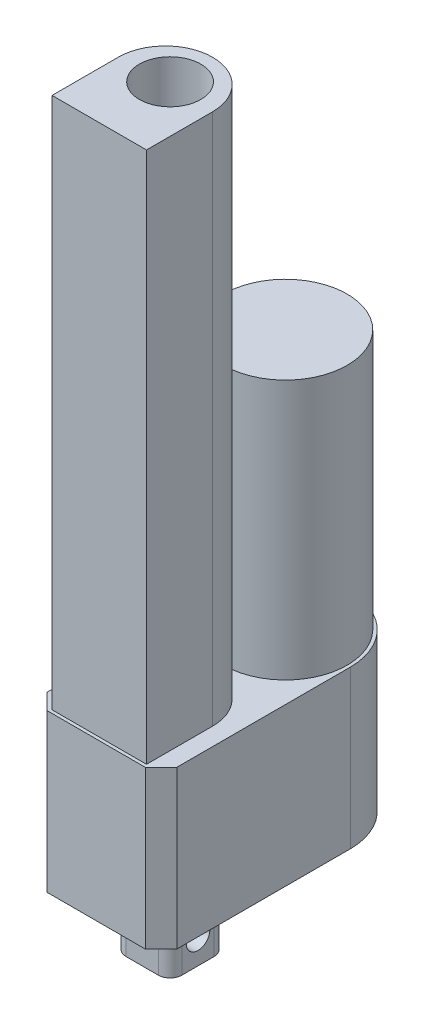
ISO-10303-21;
HEADER;
FILE_DESCRIPTION(('STEP AP214'),'2;1');
FILE_NAME('part.step','',(''),(''),'','','');
FILE_SCHEMA(('AUTOMOTIVE_DESIGN { 1 0 10303 214 1 1 1 1 }'));
ENDSEC;
DATA;
#1=APPLICATION_CONTEXT('core data for automotive mechanical design processes');
#2=APPLICATION_PROTOCOL_DEFINITION('international standard','automotive_design',2000,#1);
#3=PRODUCT_CONTEXT('',#1,'mechanical');
#4=PRODUCT('Part','Part','',(#3));
#5=PRODUCT_RELATED_PRODUCT_CATEGORY('part','',(#4));
#6=PRODUCT_DEFINITION_FORMATION('','',#4);
#7=PRODUCT_DEFINITION_CONTEXT('part definition',#1,'design');
#8=PRODUCT_DEFINITION('design','',#6,#7);
#9=PRODUCT_DEFINITION_SHAPE('','',#8);
#10=(LENGTH_UNIT() NAMED_UNIT(*) SI_UNIT(.MILLI.,.METRE.));
#11=(NAMED_UNIT(*) PLANE_ANGLE_UNIT() SI_UNIT($,.RADIAN.));
#12=(NAMED_UNIT(*) SI_UNIT($,.STERADIAN.) SOLID_ANGLE_UNIT());
#13=UNCERTAINTY_MEASURE_WITH_UNIT(LENGTH_MEASURE(1.E-05),#10,'distance_accuracy_value','');
#14=(GEOMETRIC_REPRESENTATION_CONTEXT(3) GLOBAL_UNCERTAINTY_ASSIGNED_CONTEXT((#13)) GLOBAL_UNIT_ASSIGNED_CONTEXT((#10,
#11,#12)) REPRESENTATION_CONTEXT('',''));
#15=CARTESIAN_POINT('',(0.,0.,0.));
#16=DIRECTION('',(0.,0.,1.));
#17=DIRECTION('',(1.,0.,0.));
#18=AXIS2_PLACEMENT_3D('',#15,#16,#17);
#19=CARTESIAN_POINT('',(-29.9066354603378,0.,-28.37671645601));
#20=DIRECTION('',(0.,1.,0.));
#21=DIRECTION('',(0.,0.,1.));
#22=AXIS2_PLACEMENT_3D('',#19,#20,#21);
#23=PLANE('',#22);
#24=CARTESIAN_POINT('',(-29.9066354603378,0.,-28.37671645601));
#25=DIRECTION('',(0.,1.,0.));
#26=DIRECTION('',(0.,0.,1.));
#27=AXIS2_PLACEMENT_3D('',#24,#25,#26);
#28=CIRCLE('',#27,20.9296);
#29=CARTESIAN_POINT('',(-29.9066354603376,0.,-49.30631645601));
#30=VERTEX_POINT('',#29);
#31=CARTESIAN_POINT('',(-50.8362354603378,0.,-28.3767164560098));
#32=VERTEX_POINT('',#31);
#33=EDGE_CURVE('E231',#30,#32,#28,.T.);
#34=ORIENTED_EDGE('',*,*,#33,.F.);
#35=DIRECTION('',(-1.,0.,0.));
#36=VECTOR('',#35,1.);
#37=CARTESIAN_POINT('',(-29.9066354603376,0.,-49.30631645601));
#38=LINE('',#37,#36);
#39=CARTESIAN_POINT('',(-29.8558354603379,0.,-49.30631645601));
#40=VERTEX_POINT('',#39);
#41=EDGE_CURVE('E238',#40,#30,#38,.T.);
#42=ORIENTED_EDGE('',*,*,#41,.F.);
#43=CARTESIAN_POINT('',(-29.8558354603378,0.,-28.37671645601));
#44=DIRECTION('',(0.,1.,0.));
#45=DIRECTION('',(0.,0.,-1.));
#46=AXIS2_PLACEMENT_3D('',#43,#44,#45);
#47=CIRCLE('',#46,20.9296);
#48=CARTESIAN_POINT('',(-8.92623546033779,0.,-28.3767164560098));
#49=VERTEX_POINT('',#48);
#50=EDGE_CURVE('E265',#49,#40,#47,.T.);
#51=ORIENTED_EDGE('',*,*,#50,.F.);
#52=DIRECTION('',(0.,0.,-1.));
#53=VECTOR('',#52,1.);
#54=CARTESIAN_POINT('',(-8.92623546033779,0.,-28.3767164560098));
#55=LINE('',#54,#53);
#56=CARTESIAN_POINT('',(-8.92623546033777,0.,27.65568354399));
#57=VERTEX_POINT('',#56);
#58=EDGE_CURVE('E263',#57,#49,#55,.T.);
#59=ORIENTED_EDGE('',*,*,#58,.F.);
#60=DIRECTION('',(0.707106781186549,0.,-0.707106781186546));
#61=VECTOR('',#60,1.);
#62=CARTESIAN_POINT('',(-14.0062354603378,0.,32.73568354399));
#63=LINE('',#62,#61);
#64=CARTESIAN_POINT('',(-14.0062354603378,0.,32.73568354399));
#65=VERTEX_POINT('',#64);
#66=EDGE_CURVE('E261',#65,#57,#63,.T.);
#67=ORIENTED_EDGE('',*,*,#66,.F.);
#68=DIRECTION('',(1.,0.,0.));
#69=VECTOR('',#68,1.);
#70=CARTESIAN_POINT('',(-45.7562354603378,0.,32.73568354399));
#71=LINE('',#70,#69);
#72=CARTESIAN_POINT('',(-45.7562354603378,0.,32.73568354399));
#73=VERTEX_POINT('',#72);
#74=EDGE_CURVE('E259',#73,#65,#71,.T.);
#75=ORIENTED_EDGE('',*,*,#74,.F.);
#76=DIRECTION('',(0.707106781186546,0.,0.707106781186548));
#77=VECTOR('',#76,1.);
#78=CARTESIAN_POINT('',(-50.8362354603378,0.,27.65568354399));
#79=LINE('',#78,#77);
#80=CARTESIAN_POINT('',(-50.8362354603378,0.,27.65568354399));
#81=VERTEX_POINT('',#80);
#82=EDGE_CURVE('E257',#81,#73,#79,.T.);
#83=ORIENTED_EDGE('',*,*,#82,.F.);
#84=DIRECTION('',(0.,0.,1.));
#85=VECTOR('',#84,1.);
#86=CARTESIAN_POINT('',(-50.8362354603378,0.,-28.3767164560098));
#87=LINE('',#86,#85);
#88=EDGE_CURVE('E255',#32,#81,#87,.T.);
#89=ORIENTED_EDGE('',*,*,#88,.F.);
#90=EDGE_LOOP('',(#34,#42,#51,#59,#67,#75,#83,#89));
#91=FACE_BOUND('',#90,.T.);
#92=CARTESIAN_POINT('',(-35.0882354603378,0.,3.65268354399004));
#93=DIRECTION('',(0.,-1.,0.));
#94=DIRECTION('',(0.,0.,1.));
#95=AXIS2_PLACEMENT_3D('',#92,#93,#94);
#96=CIRCLE('',#95,3.81);
#97=CARTESIAN_POINT('',(-38.8982354603378,0.,3.65268354399004));
#98=VERTEX_POINT('',#97);
#99=CARTESIAN_POINT('',(-35.0882354603378,0.,-0.157316456009964));
#100=VERTEX_POINT('',#99);
#101=EDGE_CURVE('E192',#98,#100,#96,.T.);
#102=ORIENTED_EDGE('',*,*,#101,.F.);
#103=DIRECTION('',(0.,0.,-1.));
#104=VECTOR('',#103,1.);
#105=CARTESIAN_POINT('',(-38.8982354603378,0.,3.65268354399004));
#106=LINE('',#105,#104);
#107=CARTESIAN_POINT('',(-38.8982354603378,0.,14.06668354399));
#108=VERTEX_POINT('',#107);
#109=EDGE_CURVE('E189',#108,#98,#106,.T.);
#110=ORIENTED_EDGE('',*,*,#109,.F.);
#111=CARTESIAN_POINT('',(-35.0882354603378,0.,14.06668354399));
#112=DIRECTION('',(0.,-1.,0.));
#113=DIRECTION('',(0.,0.,-1.));
#114=AXIS2_PLACEMENT_3D('',#111,#112,#113);
#115=CIRCLE('',#114,3.80999999999999);
#116=CARTESIAN_POINT('',(-35.0882354603378,0.,17.87668354399));
#117=VERTEX_POINT('',#116);
#118=EDGE_CURVE('E458',#117,#108,#115,.T.);
#119=ORIENTED_EDGE('',*,*,#118,.F.);
#120=DIRECTION('',(-1.,0.,0.));
#121=VECTOR('',#120,1.);
#122=CARTESIAN_POINT('',(-24.6742354603378,0.,17.87668354399));
#123=LINE('',#122,#121);
#124=CARTESIAN_POINT('',(-24.6742354603378,0.,17.87668354399));
#125=VERTEX_POINT('',#124);
#126=EDGE_CURVE('E455',#125,#117,#123,.T.);
#127=ORIENTED_EDGE('',*,*,#126,.F.);
#128=CARTESIAN_POINT('',(-24.6742354603378,0.,14.06668354399));
#129=DIRECTION('',(0.,-1.,0.));
#130=DIRECTION('',(0.,0.,-1.));
#131=AXIS2_PLACEMENT_3D('',#128,#129,#130);
#132=CIRCLE('',#131,3.81);
#133=CARTESIAN_POINT('',(-20.8642354603378,0.,14.06668354399));
#134=VERTEX_POINT('',#133);
#135=EDGE_CURVE('E452',#134,#125,#132,.T.);
#136=ORIENTED_EDGE('',*,*,#135,.F.);
#137=DIRECTION('',(0.,0.,1.));
#138=VECTOR('',#137,1.);
#139=CARTESIAN_POINT('',(-20.8642354603378,0.,3.65268354399004));
#140=LINE('',#139,#138);
#141=CARTESIAN_POINT('',(-20.8642354603378,0.,3.65268354399004));
#142=VERTEX_POINT('',#141);
#143=EDGE_CURVE('E449',#142,#134,#140,.T.);
#144=ORIENTED_EDGE('',*,*,#143,.F.);
#145=CARTESIAN_POINT('',(-24.6742354603378,0.,3.65268354399004));
#146=DIRECTION('',(0.,-1.,0.));
#147=DIRECTION('',(0.,0.,-1.));
#148=AXIS2_PLACEMENT_3D('',#145,#146,#147);
#149=CIRCLE('',#148,3.81);
#150=CARTESIAN_POINT('',(-24.6742354603378,0.,-0.157316456009966));
#151=VERTEX_POINT('',#150);
#152=EDGE_CURVE('E55',#151,#142,#149,.T.);
#153=ORIENTED_EDGE('',*,*,#152,.F.);
#154=DIRECTION('',(1.,0.,0.));
#155=VECTOR('',#154,1.);
#156=CARTESIAN_POINT('',(-24.6742354603378,0.,-0.157316456009964));
#157=LINE('',#156,#155);
#158=EDGE_CURVE('E50',#100,#151,#157,.T.);
#159=ORIENTED_EDGE('',*,*,#158,.F.);
#160=EDGE_LOOP('',(#102,#110,#119,#127,#136,#144,#153,#159));
#161=FACE_BOUND('',#160,.T.);
#162=ADVANCED_FACE('F35',(#91,#161),#23,.F.);
#163=CARTESIAN_POINT('',(-29.9066354603378,50.8,-28.37671645601));
#164=DIRECTION('',(0.,1.,0.));
#165=DIRECTION('',(0.,0.,1.));
#166=AXIS2_PLACEMENT_3D('',#163,#164,#165);
#167=PLANE('',#166);
#168=CARTESIAN_POINT('',(-29.8812354603378,50.8,-28.35131645601));
#169=DIRECTION('',(0.,1.,0.));
#170=DIRECTION('',(0.,0.,1.));
#171=AXIS2_PLACEMENT_3D('',#168,#169,#170);
#172=CIRCLE('',#171,19.939);
#173=CARTESIAN_POINT('',(-29.8812354603378,50.8,-8.41231645600997));
#174=VERTEX_POINT('',#173);
#175=EDGE_CURVE('E227',#174,#174,#172,.T.);
#176=ORIENTED_EDGE('',*,*,#175,.F.);
#177=EDGE_LOOP('',(#176));
#178=FACE_BOUND('',#177,.T.);
#179=CARTESIAN_POINT('',(-29.9066354603378,50.8,-28.37671645601));
#180=DIRECTION('',(0.,1.,0.));
#181=DIRECTION('',(0.,0.,1.));
#182=AXIS2_PLACEMENT_3D('',#179,#180,#181);
#183=CIRCLE('',#182,20.9296);
#184=CARTESIAN_POINT('',(-29.9066354603376,50.8,-49.30631645601));
#185=VERTEX_POINT('',#184);
#186=CARTESIAN_POINT('',(-50.8362354603378,50.8,-28.3767164560098));
#187=VERTEX_POINT('',#186);
#188=EDGE_CURVE('E234',#185,#187,#183,.T.);
#189=ORIENTED_EDGE('',*,*,#188,.T.);
#190=DIRECTION('',(0.,0.,1.));
#191=VECTOR('',#190,1.);
#192=CARTESIAN_POINT('',(-50.8362354603378,50.8,-28.3767164560098));
#193=LINE('',#192,#191);
#194=CARTESIAN_POINT('',(-50.8362354603378,50.8,27.65568354399));
#195=VERTEX_POINT('',#194);
#196=EDGE_CURVE('E237',#187,#195,#193,.T.);
#197=ORIENTED_EDGE('',*,*,#196,.T.);
#198=DIRECTION('',(0.707106781186546,0.,0.707106781186548));
#199=VECTOR('',#198,1.);
#200=CARTESIAN_POINT('',(-50.8362354603378,50.8,27.65568354399));
#201=LINE('',#200,#199);
#202=CARTESIAN_POINT('',(-45.7562354603378,50.8,32.73568354399));
#203=VERTEX_POINT('',#202);
#204=EDGE_CURVE('E240',#195,#203,#201,.T.);
#205=ORIENTED_EDGE('',*,*,#204,.T.);
#206=DIRECTION('',(1.,0.,0.));
#207=VECTOR('',#206,1.);
#208=CARTESIAN_POINT('',(-45.7562354603378,50.8,32.73568354399));
#209=LINE('',#208,#207);
#210=CARTESIAN_POINT('',(-14.0062354603378,50.8,32.73568354399));
#211=VERTEX_POINT('',#210);
#212=EDGE_CURVE('E242',#203,#211,#209,.T.);
#213=ORIENTED_EDGE('',*,*,#212,.T.);
#214=DIRECTION('',(0.707106781186549,0.,-0.707106781186546));
#215=VECTOR('',#214,1.);
#216=CARTESIAN_POINT('',(-14.0062354603378,50.8,32.73568354399));
#217=LINE('',#216,#215);
#218=CARTESIAN_POINT('',(-8.92623546033777,50.8,27.65568354399));
#219=VERTEX_POINT('',#218);
#220=EDGE_CURVE('E244',#211,#219,#217,.T.);
#221=ORIENTED_EDGE('',*,*,#220,.T.);
#222=DIRECTION('',(0.,0.,-1.));
#223=VECTOR('',#222,1.);
#224=CARTESIAN_POINT('',(-8.92623546033779,50.8,-28.3767164560098));
#225=LINE('',#224,#223);
#226=CARTESIAN_POINT('',(-8.92623546033779,50.8,-28.3767164560098));
#227=VERTEX_POINT('',#226);
#228=EDGE_CURVE('E246',#219,#227,#225,.T.);
#229=ORIENTED_EDGE('',*,*,#228,.T.);
#230=CARTESIAN_POINT('',(-29.8558354603378,50.8,-28.37671645601));
#231=DIRECTION('',(0.,1.,0.));
#232=DIRECTION('',(0.,0.,-1.));
#233=AXIS2_PLACEMENT_3D('',#230,#231,#232);
#234=CIRCLE('',#233,20.9296);
#235=CARTESIAN_POINT('',(-29.8558354603379,50.8,-49.30631645601));
#236=VERTEX_POINT('',#235);
#237=EDGE_CURVE('E248',#227,#236,#234,.T.);
#238=ORIENTED_EDGE('',*,*,#237,.T.);
#239=DIRECTION('',(-1.,0.,0.));
#240=VECTOR('',#239,1.);
#241=CARTESIAN_POINT('',(-29.9066354603376,50.8,-49.30631645601));
#242=LINE('',#241,#240);
#243=EDGE_CURVE('E250',#236,#185,#242,.T.);
#244=ORIENTED_EDGE('',*,*,#243,.T.);
#245=EDGE_LOOP('',(#189,#197,#205,#213,#221,#229,#238,#244));
#246=FACE_BOUND('',#245,.T.);
#247=DIRECTION('',(1.,0.,0.));
#248=VECTOR('',#247,1.);
#249=CARTESIAN_POINT('',(-45.1212354603378,50.8,31.7078528889851));
#250=LINE('',#249,#248);
#251=CARTESIAN_POINT('',(-45.1212354603378,50.8,31.7078528889851));
#252=VERTEX_POINT('',#251);
#253=CARTESIAN_POINT('',(-14.6412354603378,50.8,31.7078528889852));
#254=VERTEX_POINT('',#253);
#255=EDGE_CURVE('E196',#252,#254,#250,.T.);
#256=ORIENTED_EDGE('',*,*,#255,.F.);
#257=DIRECTION('',(0.,0.,1.));
#258=VECTOR('',#257,1.);
#259=CARTESIAN_POINT('',(-45.1212354603378,50.8,31.7078528889851));
#260=LINE('',#259,#258);
#261=CARTESIAN_POINT('',(-45.1212354603378,50.8,10.3718528889852));
#262=VERTEX_POINT('',#261);
#263=EDGE_CURVE('E193',#262,#252,#260,.T.);
#264=ORIENTED_EDGE('',*,*,#263,.F.);
#265=CARTESIAN_POINT('',(-29.8812354603378,50.8,10.3718528889851));
#266=DIRECTION('',(0.,1.,0.));
#267=DIRECTION('',(0.,0.,-1.));
#268=AXIS2_PLACEMENT_3D('',#265,#266,#267);
#269=CIRCLE('',#268,15.24);
#270=CARTESIAN_POINT('',(-14.6412354603378,50.8,10.3718528889851));
#271=VERTEX_POINT('',#270);
#272=EDGE_CURVE('E206',#271,#262,#269,.T.);
#273=ORIENTED_EDGE('',*,*,#272,.F.);
#274=DIRECTION('',(0.,0.,-1.));
#275=VECTOR('',#274,1.);
#276=CARTESIAN_POINT('',(-14.6412354603378,50.8,31.7078528889852));
#277=LINE('',#276,#275);
#278=EDGE_CURVE('E214',#254,#271,#277,.T.);
#279=ORIENTED_EDGE('',*,*,#278,.F.);
#280=EDGE_LOOP('',(#256,#264,#273,#279));
#281=FACE_BOUND('',#280,.T.);
#282=ADVANCED_FACE('F307',(#178,#246,#281),#167,.T.);
#283=CARTESIAN_POINT('',(-29.9066354603378,50.8,-28.37671645601));
#284=DIRECTION('',(0.,-1.,0.));
#285=DIRECTION('',(0.,0.,-1.));
#286=AXIS2_PLACEMENT_3D('',#283,#284,#285);
#287=CYLINDRICAL_SURFACE('',#286,20.9296);
#288=ORIENTED_EDGE('',*,*,#33,.T.);
#289=DIRECTION('',(0.,-1.,0.));
#290=VECTOR('',#289,1.);
#291=CARTESIAN_POINT('',(-50.8362354603378,50.8,-28.3767164560098));
#292=LINE('',#291,#290);
#293=EDGE_CURVE('E11',#187,#32,#292,.T.);
#294=ORIENTED_EDGE('',*,*,#293,.F.);
#295=ORIENTED_EDGE('',*,*,#188,.F.);
#296=DIRECTION('',(0.,-1.,0.));
#297=VECTOR('',#296,1.);
#298=CARTESIAN_POINT('',(-29.9066354603376,50.8,-49.30631645601));
#299=LINE('',#298,#297);
#300=EDGE_CURVE('E252',#185,#30,#299,.T.);
#301=ORIENTED_EDGE('',*,*,#300,.T.);
#302=EDGE_LOOP('',(#288,#294,#295,#301));
#303=FACE_BOUND('',#302,.T.);
#304=ADVANCED_FACE('F37',(#303),#287,.T.);
#305=CARTESIAN_POINT('',(-50.8362354603378,50.8,-28.3767164560098));
#306=DIRECTION('',(1.,0.,0.));
#307=DIRECTION('',(0.,0.,-1.));
#308=AXIS2_PLACEMENT_3D('',#305,#306,#307);
#309=PLANE('',#308);
#310=ORIENTED_EDGE('',*,*,#88,.T.);
#311=DIRECTION('',(0.,-1.,0.));
#312=VECTOR('',#311,1.);
#313=CARTESIAN_POINT('',(-50.8362354603378,50.8,27.65568354399));
#314=LINE('',#313,#312);
#315=EDGE_CURVE('E43',#195,#81,#314,.T.);
#316=ORIENTED_EDGE('',*,*,#315,.F.);
#317=ORIENTED_EDGE('',*,*,#196,.F.);
#318=ORIENTED_EDGE('',*,*,#293,.T.);
#319=EDGE_LOOP('',(#310,#316,#317,#318));
#320=FACE_BOUND('',#319,.T.);
#321=ADVANCED_FACE('F312',(#320),#309,.F.);
#322=CARTESIAN_POINT('',(-50.8362354603378,50.8,27.65568354399));
#323=DIRECTION('',(0.707106781186548,0.,-0.707106781186546));
#324=DIRECTION('',(-0.707106781186547,0.,-0.707106781186549));
#325=AXIS2_PLACEMENT_3D('',#322,#323,#324);
#326=PLANE('',#325);
#327=ORIENTED_EDGE('',*,*,#82,.T.);
#328=DIRECTION('',(0.,-1.,0.));
#329=VECTOR('',#328,1.);
#330=CARTESIAN_POINT('',(-45.7562354603378,50.8,32.73568354399));
#331=LINE('',#330,#329);
#332=EDGE_CURVE('E282',#203,#73,#331,.T.);
#333=ORIENTED_EDGE('',*,*,#332,.F.);
#334=ORIENTED_EDGE('',*,*,#204,.F.);
#335=ORIENTED_EDGE('',*,*,#315,.T.);
#336=EDGE_LOOP('',(#327,#333,#334,#335));
#337=FACE_BOUND('',#336,.T.);
#338=ADVANCED_FACE('F289',(#337),#326,.F.);
#339=CARTESIAN_POINT('',(-45.7562354603378,50.8,32.73568354399));
#340=DIRECTION('',(0.,0.,-1.));
#341=DIRECTION('',(-1.,0.,0.));
#342=AXIS2_PLACEMENT_3D('',#339,#340,#341);
#343=PLANE('',#342);
#344=ORIENTED_EDGE('',*,*,#74,.T.);
#345=DIRECTION('',(0.,-1.,0.));
#346=VECTOR('',#345,1.);
#347=CARTESIAN_POINT('',(-14.0062354603378,50.8,32.73568354399));
#348=LINE('',#347,#346);
#349=EDGE_CURVE('E279',#211,#65,#348,.T.);
#350=ORIENTED_EDGE('',*,*,#349,.F.);
#351=ORIENTED_EDGE('',*,*,#212,.F.);
#352=ORIENTED_EDGE('',*,*,#332,.T.);
#353=EDGE_LOOP('',(#344,#350,#351,#352));
#354=FACE_BOUND('',#353,.T.);
#355=ADVANCED_FACE('F299',(#354),#343,.F.);
#356=CARTESIAN_POINT('',(-14.0062354603378,50.8,32.73568354399));
#357=DIRECTION('',(-0.707106781186546,0.,-0.707106781186549));
#358=DIRECTION('',(-0.707106781186549,0.,0.707106781186546));
#359=AXIS2_PLACEMENT_3D('',#356,#357,#358);
#360=PLANE('',#359);
#361=ORIENTED_EDGE('',*,*,#66,.T.);
#362=DIRECTION('',(0.,-1.,0.));
#363=VECTOR('',#362,1.);
#364=CARTESIAN_POINT('',(-8.92623546033777,50.8,27.65568354399));
#365=LINE('',#364,#363);
#366=EDGE_CURVE('E276',#219,#57,#365,.T.);
#367=ORIENTED_EDGE('',*,*,#366,.F.);
#368=ORIENTED_EDGE('',*,*,#220,.F.);
#369=ORIENTED_EDGE('',*,*,#349,.T.);
#370=EDGE_LOOP('',(#361,#367,#368,#369));
#371=FACE_BOUND('',#370,.T.);
#372=ADVANCED_FACE('F303',(#371),#360,.F.);
#373=CARTESIAN_POINT('',(-8.92623546033779,50.8,-28.3767164560098));
#374=DIRECTION('',(-1.,0.,0.));
#375=DIRECTION('',(0.,0.,1.));
#376=AXIS2_PLACEMENT_3D('',#373,#374,#375);
#377=PLANE('',#376);
#378=ORIENTED_EDGE('',*,*,#58,.T.);
#379=DIRECTION('',(0.,-1.,0.));
#380=VECTOR('',#379,1.);
#381=CARTESIAN_POINT('',(-8.92623546033779,50.8,-28.3767164560098));
#382=LINE('',#381,#380);
#383=EDGE_CURVE('E273',#227,#49,#382,.T.);
#384=ORIENTED_EDGE('',*,*,#383,.F.);
#385=ORIENTED_EDGE('',*,*,#228,.F.);
#386=ORIENTED_EDGE('',*,*,#366,.T.);
#387=EDGE_LOOP('',(#378,#384,#385,#386));
#388=FACE_BOUND('',#387,.T.);
#389=ADVANCED_FACE('F325',(#388),#377,.F.);
#390=CARTESIAN_POINT('',(-29.8558354603378,50.8,-28.37671645601));
#391=DIRECTION('',(0.,-1.,0.));
#392=DIRECTION('',(0.,0.,-1.));
#393=AXIS2_PLACEMENT_3D('',#390,#391,#392);
#394=CYLINDRICAL_SURFACE('',#393,20.9296);
#395=ORIENTED_EDGE('',*,*,#50,.T.);
#396=DIRECTION('',(0.,-1.,0.));
#397=VECTOR('',#396,1.);
#398=CARTESIAN_POINT('',(-29.8558354603379,50.8,-49.30631645601));
#399=LINE('',#398,#397);
#400=EDGE_CURVE('E270',#236,#40,#399,.T.);
#401=ORIENTED_EDGE('',*,*,#400,.F.);
#402=ORIENTED_EDGE('',*,*,#237,.F.);
#403=ORIENTED_EDGE('',*,*,#383,.T.);
#404=EDGE_LOOP('',(#395,#401,#402,#403));
#405=FACE_BOUND('',#404,.T.);
#406=ADVANCED_FACE('F323',(#405),#394,.T.);
#407=CARTESIAN_POINT('',(-29.9066354603376,50.8,-49.30631645601));
#408=DIRECTION('',(0.,0.,1.));
#409=DIRECTION('',(1.,0.,0.));
#410=AXIS2_PLACEMENT_3D('',#407,#408,#409);
#411=PLANE('',#410);
#412=ORIENTED_EDGE('',*,*,#41,.T.);
#413=ORIENTED_EDGE('',*,*,#300,.F.);
#414=ORIENTED_EDGE('',*,*,#243,.F.);
#415=ORIENTED_EDGE('',*,*,#400,.T.);
#416=EDGE_LOOP('',(#412,#413,#414,#415));
#417=FACE_BOUND('',#416,.T.);
#418=ADVANCED_FACE('F318',(#417),#411,.F.);
#419=CARTESIAN_POINT('',(-29.8812354603378,134.62,-28.35131645601));
#420=DIRECTION('',(0.,-1.,0.));
#421=DIRECTION('',(0.,0.,-1.));
#422=AXIS2_PLACEMENT_3D('',#419,#420,#421);
#423=CYLINDRICAL_SURFACE('',#422,19.939);
#424=CARTESIAN_POINT('',(-29.8812354603378,134.62,-28.35131645601));
#425=DIRECTION('',(0.,1.,0.));
#426=DIRECTION('',(0.,0.,1.));
#427=AXIS2_PLACEMENT_3D('',#424,#425,#426);
#428=CIRCLE('',#427,19.939);
#429=CARTESIAN_POINT('',(-29.8812354603378,134.62,-8.41231645600997));
#430=VERTEX_POINT('',#429);
#431=EDGE_CURVE('E228',#430,#430,#428,.T.);
#432=ORIENTED_EDGE('',*,*,#431,.F.);
#433=EDGE_LOOP('',(#432));
#434=FACE_BOUND('',#433,.T.);
#435=ORIENTED_EDGE('',*,*,#175,.T.);
#436=EDGE_LOOP('',(#435));
#437=FACE_BOUND('',#436,.T.);
#438=ADVANCED_FACE('F344',(#434,#437),#423,.T.);
#439=CARTESIAN_POINT('',(-29.8812354603378,134.62,-28.35131645601));
#440=DIRECTION('',(0.,1.,0.));
#441=DIRECTION('',(0.,0.,1.));
#442=AXIS2_PLACEMENT_3D('',#439,#440,#441);
#443=PLANE('',#442);
#444=ORIENTED_EDGE('',*,*,#431,.T.);
#445=EDGE_LOOP('',(#444));
#446=FACE_BOUND('',#445,.T.);
#447=ADVANCED_FACE('F348',(#446),#443,.T.);
#448=CARTESIAN_POINT('',(-45.1212354603378,222.504,31.7078528889851));
#449=DIRECTION('',(1.,0.,0.));
#450=DIRECTION('',(0.,0.,-1.));
#451=AXIS2_PLACEMENT_3D('',#448,#449,#450);
#452=PLANE('',#451);
#453=ORIENTED_EDGE('',*,*,#263,.T.);
#454=DIRECTION('',(0.,-1.,0.));
#455=VECTOR('',#454,1.);
#456=CARTESIAN_POINT('',(-45.1212354603378,222.504,31.7078528889851));
#457=LINE('',#456,#455);
#458=CARTESIAN_POINT('',(-45.1212354603378,222.504,31.7078528889851));
#459=VERTEX_POINT('',#458);
#460=EDGE_CURVE('E225',#459,#252,#457,.T.);
#461=ORIENTED_EDGE('',*,*,#460,.F.);
#462=DIRECTION('',(0.,0.,1.));
#463=VECTOR('',#462,1.);
#464=CARTESIAN_POINT('',(-45.1212354603378,222.504,31.7078528889851));
#465=LINE('',#464,#463);
#466=CARTESIAN_POINT('',(-45.1212354603378,222.504,10.3718528889852));
#467=VERTEX_POINT('',#466);
#468=EDGE_CURVE('E202',#467,#459,#465,.T.);
#469=ORIENTED_EDGE('',*,*,#468,.F.);
#470=DIRECTION('',(0.,-1.,0.));
#471=VECTOR('',#470,1.);
#472=CARTESIAN_POINT('',(-45.1212354603378,222.504,10.3718528889852));
#473=LINE('',#472,#471);
#474=EDGE_CURVE('E211',#467,#262,#473,.T.);
#475=ORIENTED_EDGE('',*,*,#474,.T.);
#476=EDGE_LOOP('',(#453,#461,#469,#475));
#477=FACE_BOUND('',#476,.T.);
#478=ADVANCED_FACE('F353',(#477),#452,.F.);
#479=CARTESIAN_POINT('',(-45.1212354603378,222.504,31.7078528889851));
#480=DIRECTION('',(0.,0.,-1.));
#481=DIRECTION('',(-1.,0.,0.));
#482=AXIS2_PLACEMENT_3D('',#479,#480,#481);
#483=PLANE('',#482);
#484=ORIENTED_EDGE('',*,*,#255,.T.);
#485=DIRECTION('',(0.,-1.,0.));
#486=VECTOR('',#485,1.);
#487=CARTESIAN_POINT('',(-14.6412354603378,222.504,31.7078528889852));
#488=LINE('',#487,#486);
#489=CARTESIAN_POINT('',(-14.6412354603378,222.504,31.7078528889852));
#490=VERTEX_POINT('',#489);
#491=EDGE_CURVE('E222',#490,#254,#488,.T.);
#492=ORIENTED_EDGE('',*,*,#491,.F.);
#493=DIRECTION('',(1.,0.,0.));
#494=VECTOR('',#493,1.);
#495=CARTESIAN_POINT('',(-45.1212354603378,222.504,31.7078528889851));
#496=LINE('',#495,#494);
#497=EDGE_CURVE('E205',#459,#490,#496,.T.);
#498=ORIENTED_EDGE('',*,*,#497,.F.);
#499=ORIENTED_EDGE('',*,*,#460,.T.);
#500=EDGE_LOOP('',(#484,#492,#498,#499));
#501=FACE_BOUND('',#500,.T.);
#502=ADVANCED_FACE('F361',(#501),#483,.F.);
#503=CARTESIAN_POINT('',(-14.6412354603378,222.504,31.7078528889852));
#504=DIRECTION('',(-1.,0.,0.));
#505=DIRECTION('',(0.,0.,1.));
#506=AXIS2_PLACEMENT_3D('',#503,#504,#505);
#507=PLANE('',#506);
#508=ORIENTED_EDGE('',*,*,#278,.T.);
#509=DIRECTION('',(0.,-1.,0.));
#510=VECTOR('',#509,1.);
#511=CARTESIAN_POINT('',(-14.6412354603378,222.504,10.3718528889851));
#512=LINE('',#511,#510);
#513=CARTESIAN_POINT('',(-14.6412354603378,222.504,10.3718528889851));
#514=VERTEX_POINT('',#513);
#515=EDGE_CURVE('E220',#514,#271,#512,.T.);
#516=ORIENTED_EDGE('',*,*,#515,.F.);
#517=DIRECTION('',(0.,0.,-1.));
#518=VECTOR('',#517,1.);
#519=CARTESIAN_POINT('',(-14.6412354603378,222.504,31.7078528889852));
#520=LINE('',#519,#518);
#521=EDGE_CURVE('E208',#490,#514,#520,.T.);
#522=ORIENTED_EDGE('',*,*,#521,.F.);
#523=ORIENTED_EDGE('',*,*,#491,.T.);
#524=EDGE_LOOP('',(#508,#516,#522,#523));
#525=FACE_BOUND('',#524,.T.);
#526=ADVANCED_FACE('F365',(#525),#507,.F.);
#527=CARTESIAN_POINT('',(-29.8812354603378,222.504,10.3718528889851));
#528=DIRECTION('',(0.,-1.,0.));
#529=DIRECTION('',(0.,0.,-1.));
#530=AXIS2_PLACEMENT_3D('',#527,#528,#529);
#531=CYLINDRICAL_SURFACE('',#530,15.24);
#532=ORIENTED_EDGE('',*,*,#272,.T.);
#533=ORIENTED_EDGE('',*,*,#474,.F.);
#534=CARTESIAN_POINT('',(-29.8812354603378,222.504,10.3718528889851));
#535=DIRECTION('',(0.,1.,0.));
#536=DIRECTION('',(0.,0.,-1.));
#537=AXIS2_PLACEMENT_3D('',#534,#535,#536);
#538=CIRCLE('',#537,15.24);
#539=EDGE_CURVE('E210',#514,#467,#538,.T.);
#540=ORIENTED_EDGE('',*,*,#539,.F.);
#541=ORIENTED_EDGE('',*,*,#515,.T.);
#542=EDGE_LOOP('',(#532,#533,#540,#541));
#543=FACE_BOUND('',#542,.T.);
#544=ADVANCED_FACE('F369',(#543),#531,.T.);
#545=CARTESIAN_POINT('',(-29.8812354603378,222.504,10.3718528889851));
#546=DIRECTION('',(0.,-1.,0.));
#547=DIRECTION('',(0.,0.,-1.));
#548=AXIS2_PLACEMENT_3D('',#545,#546,#547);
#549=PLANE('',#548);
#550=CARTESIAN_POINT('',(-29.8812354603378,222.504,8.85968354399003));
#551=DIRECTION('',(0.,1.,0.));
#552=DIRECTION('',(0.,0.,1.));
#553=AXIS2_PLACEMENT_3D('',#550,#551,#552);
#554=CIRCLE('',#553,9.906);
#555=CARTESIAN_POINT('',(-29.8812354603378,222.504,18.76568354399));
#556=VERTEX_POINT('',#555);
#557=EDGE_CURVE('E425',#556,#556,#554,.T.);
#558=ORIENTED_EDGE('',*,*,#557,.F.);
#559=EDGE_LOOP('',(#558));
#560=FACE_BOUND('',#559,.T.);
#561=ORIENTED_EDGE('',*,*,#468,.T.);
#562=ORIENTED_EDGE('',*,*,#497,.T.);
#563=ORIENTED_EDGE('',*,*,#521,.T.);
#564=ORIENTED_EDGE('',*,*,#539,.T.);
#565=EDGE_LOOP('',(#561,#562,#563,#564));
#566=FACE_BOUND('',#565,.T.);
#567=ADVANCED_FACE('F373',(#560,#566),#549,.F.);
#568=CARTESIAN_POINT('',(-35.0882354603378,-20.066,3.65268354399004));
#569=DIRECTION('',(0.,1.,0.));
#570=DIRECTION('',(0.,0.,1.));
#571=AXIS2_PLACEMENT_3D('',#568,#569,#570);
#572=CYLINDRICAL_SURFACE('',#571,3.81);
#573=ORIENTED_EDGE('',*,*,#101,.T.);
#574=DIRECTION('',(0.,1.,0.));
#575=VECTOR('',#574,1.);
#576=CARTESIAN_POINT('',(-35.0882354603378,-20.066,-0.157316456009964));
#577=LINE('',#576,#575);
#578=CARTESIAN_POINT('',(-35.0882354603378,-20.066,-0.157316456009964));
#579=VERTEX_POINT('',#578);
#580=EDGE_CURVE('E173',#579,#100,#577,.T.);
#581=ORIENTED_EDGE('',*,*,#580,.F.);
#582=CARTESIAN_POINT('',(-35.0882354603378,-20.066,3.65268354399004));
#583=DIRECTION('',(0.,-1.,0.));
#584=DIRECTION('',(0.,0.,1.));
#585=AXIS2_PLACEMENT_3D('',#582,#583,#584);
#586=CIRCLE('',#585,3.81);
#587=CARTESIAN_POINT('',(-38.8982354603378,-20.066,3.65268354399004));
#588=VERTEX_POINT('',#587);
#589=EDGE_CURVE('E180',#588,#579,#586,.T.);
#590=ORIENTED_EDGE('',*,*,#589,.F.);
#591=DIRECTION('',(0.,1.,0.));
#592=VECTOR('',#591,1.);
#593=CARTESIAN_POINT('',(-38.8982354603378,-20.066,3.65268354399004));
#594=LINE('',#593,#592);
#595=EDGE_CURVE('E445',#588,#98,#594,.T.);
#596=ORIENTED_EDGE('',*,*,#595,.T.);
#597=EDGE_LOOP('',(#573,#581,#590,#596));
#598=FACE_BOUND('',#597,.T.);
#599=ADVANCED_FACE('F191',(#598),#572,.T.);
#600=CARTESIAN_POINT('',(-24.6742354603378,-20.066,-0.157316456009964));
#601=DIRECTION('',(0.,0.,1.));
#602=DIRECTION('',(1.,0.,0.));
#603=AXIS2_PLACEMENT_3D('',#600,#601,#602);
#604=PLANE('',#603);
#605=ORIENTED_EDGE('',*,*,#158,.T.);
#606=DIRECTION('',(0.,1.,0.));
#607=VECTOR('',#606,1.);
#608=CARTESIAN_POINT('',(-24.6742354603378,-20.066,-0.157316456009964));
#609=LINE('',#608,#607);
#610=CARTESIAN_POINT('',(-24.6742354603378,-20.066,-0.157316456009964));
#611=VERTEX_POINT('',#610);
#612=EDGE_CURVE('E176',#611,#151,#609,.T.);
#613=ORIENTED_EDGE('',*,*,#612,.F.);
#614=DIRECTION('',(1.,0.,0.));
#615=VECTOR('',#614,1.);
#616=CARTESIAN_POINT('',(-24.6742354603378,-20.066,-0.157316456009964));
#617=LINE('',#616,#615);
#618=EDGE_CURVE('E169',#579,#611,#617,.T.);
#619=ORIENTED_EDGE('',*,*,#618,.F.);
#620=ORIENTED_EDGE('',*,*,#580,.T.);
#621=EDGE_LOOP('',(#605,#613,#619,#620));
#622=FACE_BOUND('',#621,.T.);
#623=ADVANCED_FACE('F171',(#622),#604,.F.);
#624=CARTESIAN_POINT('',(-24.6742354603378,-20.066,3.65268354399004));
#625=DIRECTION('',(0.,1.,0.));
#626=DIRECTION('',(0.,0.,1.));
#627=AXIS2_PLACEMENT_3D('',#624,#625,#626);
#628=CYLINDRICAL_SURFACE('',#627,3.81);
#629=ORIENTED_EDGE('',*,*,#152,.T.);
#630=DIRECTION('',(0.,1.,0.));
#631=VECTOR('',#630,1.);
#632=CARTESIAN_POINT('',(-20.8642354603378,-20.066,3.65268354399004));
#633=LINE('',#632,#631);
#634=CARTESIAN_POINT('',(-20.8642354603378,-20.066,3.65268354399004));
#635=VERTEX_POINT('',#634);
#636=EDGE_CURVE('E198',#635,#142,#633,.T.);
#637=ORIENTED_EDGE('',*,*,#636,.F.);
#638=CARTESIAN_POINT('',(-24.6742354603378,-20.066,3.65268354399004));
#639=DIRECTION('',(0.,-1.,0.));
#640=DIRECTION('',(0.,0.,-1.));
#641=AXIS2_PLACEMENT_3D('',#638,#639,#640);
#642=CIRCLE('',#641,3.81);
#643=EDGE_CURVE('E179',#611,#635,#642,.T.);
#644=ORIENTED_EDGE('',*,*,#643,.F.);
#645=ORIENTED_EDGE('',*,*,#612,.T.);
#646=EDGE_LOOP('',(#629,#637,#644,#645));
#647=FACE_BOUND('',#646,.T.);
#648=ADVANCED_FACE('F382',(#647),#628,.T.);
#649=CARTESIAN_POINT('',(-20.8642354603378,-20.066,3.65268354399004));
#650=DIRECTION('',(-1.,0.,0.));
#651=DIRECTION('',(0.,0.,1.));
#652=AXIS2_PLACEMENT_3D('',#649,#650,#651);
#653=PLANE('',#652);
#654=CARTESIAN_POINT('',(-20.8642354603378,-11.938,8.85968354399004));
#655=DIRECTION('',(-1.,0.,0.));
#656=DIRECTION('',(0.,0.,1.));
#657=AXIS2_PLACEMENT_3D('',#654,#655,#656);
#658=CIRCLE('',#657,3.81);
#659=CARTESIAN_POINT('',(-20.8642354603378,-11.938,12.66968354399));
#660=VERTEX_POINT('',#659);
#661=EDGE_CURVE('E428',#660,#660,#658,.T.);
#662=ORIENTED_EDGE('',*,*,#661,.T.);
#663=EDGE_LOOP('',(#662));
#664=FACE_BOUND('',#663,.T.);
#665=ORIENTED_EDGE('',*,*,#143,.T.);
#666=DIRECTION('',(0.,1.,0.));
#667=VECTOR('',#666,1.);
#668=CARTESIAN_POINT('',(-20.8642354603378,-20.066,14.06668354399));
#669=LINE('',#668,#667);
#670=CARTESIAN_POINT('',(-20.8642354603378,-20.066,14.06668354399));
#671=VERTEX_POINT('',#670);
#672=EDGE_CURVE('E473',#671,#134,#669,.T.);
#673=ORIENTED_EDGE('',*,*,#672,.F.);
#674=DIRECTION('',(0.,0.,1.));
#675=VECTOR('',#674,1.);
#676=CARTESIAN_POINT('',(-20.8642354603378,-20.066,3.65268354399004));
#677=LINE('',#676,#675);
#678=EDGE_CURVE('E436',#635,#671,#677,.T.);
#679=ORIENTED_EDGE('',*,*,#678,.F.);
#680=ORIENTED_EDGE('',*,*,#636,.T.);
#681=EDGE_LOOP('',(#665,#673,#679,#680));
#682=FACE_BOUND('',#681,.T.);
#683=ADVANCED_FACE('F385',(#664,#682),#653,.F.);
#684=CARTESIAN_POINT('',(-24.6742354603378,-20.066,14.06668354399));
#685=DIRECTION('',(0.,1.,0.));
#686=DIRECTION('',(0.,0.,1.));
#687=AXIS2_PLACEMENT_3D('',#684,#685,#686);
#688=CYLINDRICAL_SURFACE('',#687,3.81);
#689=ORIENTED_EDGE('',*,*,#135,.T.);
#690=DIRECTION('',(0.,1.,0.));
#691=VECTOR('',#690,1.);
#692=CARTESIAN_POINT('',(-24.6742354603378,-20.066,17.87668354399));
#693=LINE('',#692,#691);
#694=CARTESIAN_POINT('',(-24.6742354603378,-20.066,17.87668354399));
#695=VERTEX_POINT('',#694);
#696=EDGE_CURVE('E470',#695,#125,#693,.T.);
#697=ORIENTED_EDGE('',*,*,#696,.F.);
#698=CARTESIAN_POINT('',(-24.6742354603378,-20.066,14.06668354399));
#699=DIRECTION('',(0.,-1.,0.));
#700=DIRECTION('',(0.,0.,-1.));
#701=AXIS2_PLACEMENT_3D('',#698,#699,#700);
#702=CIRCLE('',#701,3.81);
#703=EDGE_CURVE('E438',#671,#695,#702,.T.);
#704=ORIENTED_EDGE('',*,*,#703,.F.);
#705=ORIENTED_EDGE('',*,*,#672,.T.);
#706=EDGE_LOOP('',(#689,#697,#704,#705));
#707=FACE_BOUND('',#706,.T.);
#708=ADVANCED_FACE('F389',(#707),#688,.T.);
#709=CARTESIAN_POINT('',(-24.6742354603378,-20.066,17.87668354399));
#710=DIRECTION('',(0.,0.,-1.));
#711=DIRECTION('',(-1.,0.,0.));
#712=AXIS2_PLACEMENT_3D('',#709,#710,#711);
#713=PLANE('',#712);
#714=ORIENTED_EDGE('',*,*,#126,.T.);
#715=DIRECTION('',(0.,1.,0.));
#716=VECTOR('',#715,1.);
#717=CARTESIAN_POINT('',(-35.0882354603378,-20.066,17.87668354399));
#718=LINE('',#717,#716);
#719=CARTESIAN_POINT('',(-35.0882354603378,-20.066,17.87668354399));
#720=VERTEX_POINT('',#719);
#721=EDGE_CURVE('E467',#720,#117,#718,.T.);
#722=ORIENTED_EDGE('',*,*,#721,.F.);
#723=DIRECTION('',(-1.,0.,0.));
#724=VECTOR('',#723,1.);
#725=CARTESIAN_POINT('',(-24.6742354603378,-20.066,17.87668354399));
#726=LINE('',#725,#724);
#727=EDGE_CURVE('E440',#695,#720,#726,.T.);
#728=ORIENTED_EDGE('',*,*,#727,.F.);
#729=ORIENTED_EDGE('',*,*,#696,.T.);
#730=EDGE_LOOP('',(#714,#722,#728,#729));
#731=FACE_BOUND('',#730,.T.);
#732=ADVANCED_FACE('F393',(#731),#713,.F.);
#733=CARTESIAN_POINT('',(-35.0882354603378,-20.066,14.06668354399));
#734=DIRECTION('',(0.,1.,0.));
#735=DIRECTION('',(0.,0.,1.));
#736=AXIS2_PLACEMENT_3D('',#733,#734,#735);
#737=CYLINDRICAL_SURFACE('',#736,3.80999999999999);
#738=ORIENTED_EDGE('',*,*,#118,.T.);
#739=DIRECTION('',(0.,1.,0.));
#740=VECTOR('',#739,1.);
#741=CARTESIAN_POINT('',(-38.8982354603378,-20.066,14.06668354399));
#742=LINE('',#741,#740);
#743=CARTESIAN_POINT('',(-38.8982354603378,-20.066,14.06668354399));
#744=VERTEX_POINT('',#743);
#745=EDGE_CURVE('E464',#744,#108,#742,.T.);
#746=ORIENTED_EDGE('',*,*,#745,.F.);
#747=CARTESIAN_POINT('',(-35.0882354603378,-20.066,14.06668354399));
#748=DIRECTION('',(0.,-1.,0.));
#749=DIRECTION('',(0.,0.,-1.));
#750=AXIS2_PLACEMENT_3D('',#747,#748,#749);
#751=CIRCLE('',#750,3.80999999999999);
#752=EDGE_CURVE('E442',#720,#744,#751,.T.);
#753=ORIENTED_EDGE('',*,*,#752,.F.);
#754=ORIENTED_EDGE('',*,*,#721,.T.);
#755=EDGE_LOOP('',(#738,#746,#753,#754));
#756=FACE_BOUND('',#755,.T.);
#757=ADVANCED_FACE('F397',(#756),#737,.T.);
#758=CARTESIAN_POINT('',(-38.8982354603378,-20.066,3.65268354399004));
#759=DIRECTION('',(1.,0.,0.));
#760=DIRECTION('',(0.,0.,-1.));
#761=AXIS2_PLACEMENT_3D('',#758,#759,#760);
#762=PLANE('',#761);
#763=CARTESIAN_POINT('',(-38.8982354603378,-11.938,8.85968354399004));
#764=DIRECTION('',(-1.,0.,0.));
#765=DIRECTION('',(0.,0.,1.));
#766=AXIS2_PLACEMENT_3D('',#763,#764,#765);
#767=CIRCLE('',#766,3.81);
#768=CARTESIAN_POINT('',(-38.8982354603378,-11.938,12.66968354399));
#769=VERTEX_POINT('',#768);
#770=EDGE_CURVE('E424',#769,#769,#767,.T.);
#771=ORIENTED_EDGE('',*,*,#770,.F.);
#772=EDGE_LOOP('',(#771));
#773=FACE_BOUND('',#772,.T.);
#774=ORIENTED_EDGE('',*,*,#109,.T.);
#775=ORIENTED_EDGE('',*,*,#595,.F.);
#776=DIRECTION('',(0.,0.,-1.));
#777=VECTOR('',#776,1.);
#778=CARTESIAN_POINT('',(-38.8982354603378,-20.066,3.65268354399004));
#779=LINE('',#778,#777);
#780=EDGE_CURVE('E185',#744,#588,#779,.T.);
#781=ORIENTED_EDGE('',*,*,#780,.F.);
#782=ORIENTED_EDGE('',*,*,#745,.T.);
#783=EDGE_LOOP('',(#774,#775,#781,#782));
#784=FACE_BOUND('',#783,.T.);
#785=ADVANCED_FACE('F401',(#773,#784),#762,.F.);
#786=CARTESIAN_POINT('',(-35.0882354603378,-20.066,3.65268354399004));
#787=DIRECTION('',(0.,1.,0.));
#788=DIRECTION('',(0.,0.,1.));
#789=AXIS2_PLACEMENT_3D('',#786,#787,#788);
#790=PLANE('',#789);
#791=ORIENTED_EDGE('',*,*,#589,.T.);
#792=ORIENTED_EDGE('',*,*,#618,.T.);
#793=ORIENTED_EDGE('',*,*,#643,.T.);
#794=ORIENTED_EDGE('',*,*,#678,.T.);
#795=ORIENTED_EDGE('',*,*,#703,.T.);
#796=ORIENTED_EDGE('',*,*,#727,.T.);
#797=ORIENTED_EDGE('',*,*,#752,.T.);
#798=ORIENTED_EDGE('',*,*,#780,.T.);
#799=EDGE_LOOP('',(#791,#792,#793,#794,#795,#796,#797,#798));
#800=FACE_BOUND('',#799,.T.);
#801=ADVANCED_FACE('F183',(#800),#790,.F.);
#802=CARTESIAN_POINT('',(-18.8322354603378,-11.938,8.85968354399004));
#803=DIRECTION('',(-1.,0.,0.));
#804=DIRECTION('',(0.,0.,1.));
#805=AXIS2_PLACEMENT_3D('',#802,#803,#804);
#806=CYLINDRICAL_SURFACE('',#805,3.81);
#807=ORIENTED_EDGE('',*,*,#770,.T.);
#808=EDGE_LOOP('',(#807));
#809=FACE_BOUND('',#808,.T.);
#810=ORIENTED_EDGE('',*,*,#661,.F.);
#811=EDGE_LOOP('',(#810));
#812=FACE_BOUND('',#811,.T.);
#813=ADVANCED_FACE('F408',(#809,#812),#806,.F.);
#814=CARTESIAN_POINT('',(-29.8812354603378,95.504,8.85968354399003));
#815=DIRECTION('',(0.,1.,0.));
#816=DIRECTION('',(0.,0.,1.));
#817=AXIS2_PLACEMENT_3D('',#814,#815,#816);
#818=CYLINDRICAL_SURFACE('',#817,9.906);
#819=CARTESIAN_POINT('',(-29.8812354603378,95.504,8.85968354399003));
#820=DIRECTION('',(0.,1.,0.));
#821=DIRECTION('',(0.,0.,1.));
#822=AXIS2_PLACEMENT_3D('',#819,#820,#821);
#823=CIRCLE('',#822,9.906);
#824=CARTESIAN_POINT('',(-29.8812354603378,95.504,18.76568354399));
#825=VERTEX_POINT('',#824);
#826=EDGE_CURVE('E423',#825,#825,#823,.T.);
#827=ORIENTED_EDGE('',*,*,#826,.F.);
#828=EDGE_LOOP('',(#827));
#829=FACE_BOUND('',#828,.T.);
#830=ORIENTED_EDGE('',*,*,#557,.T.);
#831=EDGE_LOOP('',(#830));
#832=FACE_BOUND('',#831,.T.);
#833=ADVANCED_FACE('F411',(#829,#832),#818,.F.);
#834=CARTESIAN_POINT('',(-29.8812354603378,95.504,8.85968354399003));
#835=DIRECTION('',(0.,1.,0.));
#836=DIRECTION('',(0.,0.,1.));
#837=AXIS2_PLACEMENT_3D('',#834,#835,#836);
#838=PLANE('',#837);
#839=ORIENTED_EDGE('',*,*,#826,.T.);
#840=EDGE_LOOP('',(#839));
#841=FACE_BOUND('',#840,.T.);
#842=ADVANCED_FACE('F415',(#841),#838,.T.);
#843=CLOSED_SHELL('',(#162,#282,#304,#321,#338,#355,#372,#389,#406,#418,#438,#447,#478,#502,
#526,#544,#567,#599,#623,#648,#683,#708,#732,#757,#785,#801,#813,#833,#842));
#844=MANIFOLD_SOLID_BREP('B2',#843);
#845=ADVANCED_BREP_SHAPE_REPRESENTATION('',(#18,#844),#14);
#846=SHAPE_DEFINITION_REPRESENTATION(#9,#845);
ENDSEC;
END-ISO-10303-21;
